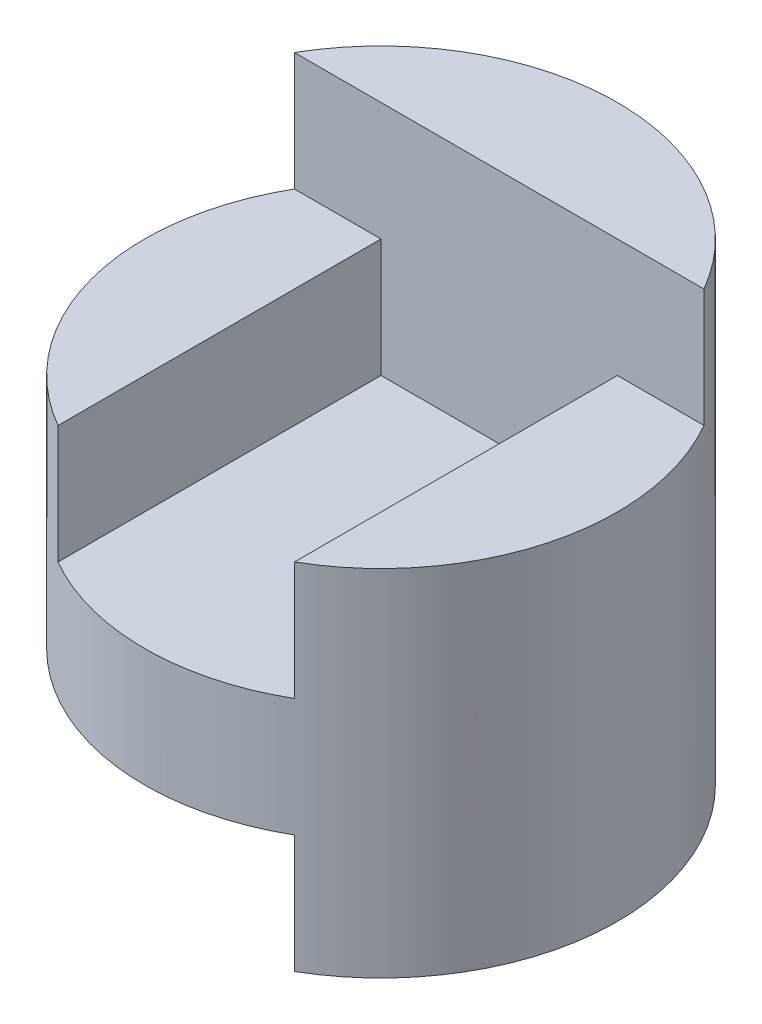
ISO-10303-21;
HEADER;
FILE_DESCRIPTION(('STEP AP214'),'2;1');
FILE_NAME('part.step','',(''),(''),'','','');
FILE_SCHEMA(('AUTOMOTIVE_DESIGN { 1 0 10303 214 1 1 1 1 }'));
ENDSEC;
DATA;
#1=APPLICATION_CONTEXT('core data for automotive mechanical design processes');
#2=APPLICATION_PROTOCOL_DEFINITION('international standard','automotive_design',2000,#1);
#3=PRODUCT_CONTEXT('',#1,'mechanical');
#4=PRODUCT('Part','Part','',(#3));
#5=PRODUCT_RELATED_PRODUCT_CATEGORY('part','',(#4));
#6=PRODUCT_DEFINITION_FORMATION('','',#4);
#7=PRODUCT_DEFINITION_CONTEXT('part definition',#1,'design');
#8=PRODUCT_DEFINITION('design','',#6,#7);
#9=PRODUCT_DEFINITION_SHAPE('','',#8);
#10=(LENGTH_UNIT() NAMED_UNIT(*) SI_UNIT(.MILLI.,.METRE.));
#11=(NAMED_UNIT(*) PLANE_ANGLE_UNIT() SI_UNIT($,.RADIAN.));
#12=(NAMED_UNIT(*) SI_UNIT($,.STERADIAN.) SOLID_ANGLE_UNIT());
#13=UNCERTAINTY_MEASURE_WITH_UNIT(LENGTH_MEASURE(1.E-05),#10,'distance_accuracy_value','');
#14=(GEOMETRIC_REPRESENTATION_CONTEXT(3) GLOBAL_UNCERTAINTY_ASSIGNED_CONTEXT((#13)) GLOBAL_UNIT_ASSIGNED_CONTEXT((#10,
#11,#12)) REPRESENTATION_CONTEXT('',''));
#15=CARTESIAN_POINT('',(0.,0.,0.));
#16=DIRECTION('',(0.,0.,1.));
#17=DIRECTION('',(1.,0.,0.));
#18=AXIS2_PLACEMENT_3D('',#15,#16,#17);
#19=CARTESIAN_POINT('',(0.,4.,0.));
#20=DIRECTION('',(0.,-1.,0.));
#21=DIRECTION('',(0.,0.,-1.));
#22=AXIS2_PLACEMENT_3D('',#19,#20,#21);
#23=CYLINDRICAL_SURFACE('',#22,2.);
#24=CARTESIAN_POINT('',(0.,0.,0.));
#25=DIRECTION('',(0.,1.,0.));
#26=DIRECTION('',(0.,0.,1.));
#27=AXIS2_PLACEMENT_3D('',#24,#25,#26);
#28=CIRCLE('',#27,2.);
#29=CARTESIAN_POINT('',(1.,0.,1.73205080756888));
#30=VERTEX_POINT('',#29);
#31=CARTESIAN_POINT('',(-1.73205080756888,0.,-1.));
#32=VERTEX_POINT('',#31);
#33=EDGE_CURVE('E155',#30,#32,#28,.T.);
#34=ORIENTED_EDGE('',*,*,#33,.T.);
#35=DIRECTION('',(0.,-1.,0.));
#36=VECTOR('',#35,1.);
#37=CARTESIAN_POINT('',(-1.73205080756888,1.,-1.));
#38=LINE('',#37,#36);
#39=CARTESIAN_POINT('',(-1.73205080756888,1.,-1.));
#40=VERTEX_POINT('',#39);
#41=EDGE_CURVE('E126',#40,#32,#38,.T.);
#42=ORIENTED_EDGE('',*,*,#41,.F.);
#43=CARTESIAN_POINT('',(0.,1.,0.));
#44=DIRECTION('',(0.,-1.,0.));
#45=DIRECTION('',(0.,0.,1.));
#46=AXIS2_PLACEMENT_3D('',#43,#44,#45);
#47=CIRCLE('',#46,2.);
#48=CARTESIAN_POINT('',(1.,1.,1.73205080756888));
#49=VERTEX_POINT('',#48);
#50=EDGE_CURVE('E109',#49,#40,#47,.T.);
#51=ORIENTED_EDGE('',*,*,#50,.F.);
#52=DIRECTION('',(0.,-1.,0.));
#53=VECTOR('',#52,1.);
#54=CARTESIAN_POINT('',(1.,1.,1.73205080756888));
#55=LINE('',#54,#53);
#56=EDGE_CURVE('E108',#49,#30,#55,.T.);
#57=ORIENTED_EDGE('',*,*,#56,.T.);
#58=EDGE_LOOP('',(#34,#42,#51,#57));
#59=FACE_BOUND('',#58,.T.);
#60=DIRECTION('',(0.,-1.,0.));
#61=VECTOR('',#60,1.);
#62=CARTESIAN_POINT('',(1.73205080756888,4.,-1.));
#63=LINE('',#62,#61);
#64=CARTESIAN_POINT('',(1.73205080756888,4.,-1.));
#65=VERTEX_POINT('',#64);
#66=CARTESIAN_POINT('',(1.73205080756888,3.,-1.));
#67=VERTEX_POINT('',#66);
#68=EDGE_CURVE('E55',#65,#67,#63,.T.);
#69=ORIENTED_EDGE('',*,*,#68,.T.);
#70=CARTESIAN_POINT('',(0.,3.,0.));
#71=DIRECTION('',(0.,1.,0.));
#72=DIRECTION('',(0.,0.,1.));
#73=AXIS2_PLACEMENT_3D('',#70,#71,#72);
#74=CIRCLE('',#73,2.);
#75=CARTESIAN_POINT('',(1.,3.,1.73205080756888));
#76=VERTEX_POINT('',#75);
#77=EDGE_CURVE('E11',#76,#67,#74,.T.);
#78=ORIENTED_EDGE('',*,*,#77,.F.);
#79=DIRECTION('',(0.,-1.,0.));
#80=VECTOR('',#79,1.);
#81=CARTESIAN_POINT('',(1.,4.,1.73205080756888));
#82=LINE('',#81,#80);
#83=CARTESIAN_POINT('',(1.,2.,1.73205080756888));
#84=VERTEX_POINT('',#83);
#85=EDGE_CURVE('E40',#84,#76,#82,.F.);
#86=ORIENTED_EDGE('',*,*,#85,.F.);
#87=CARTESIAN_POINT('',(0.,2.,0.));
#88=DIRECTION('',(0.,1.,0.));
#89=DIRECTION('',(-1.,0.,0.));
#90=AXIS2_PLACEMENT_3D('',#87,#88,#89);
#91=CIRCLE('',#90,2.);
#92=CARTESIAN_POINT('',(-1.,2.,1.73205080756888));
#93=VERTEX_POINT('',#92);
#94=EDGE_CURVE('E167',#93,#84,#91,.T.);
#95=ORIENTED_EDGE('',*,*,#94,.F.);
#96=DIRECTION('',(0.,-1.,0.));
#97=VECTOR('',#96,1.);
#98=CARTESIAN_POINT('',(-1.,4.,1.73205080756888));
#99=LINE('',#98,#97);
#100=CARTESIAN_POINT('',(-1.,3.,1.73205080756888));
#101=VERTEX_POINT('',#100);
#102=EDGE_CURVE('E165',#101,#93,#99,.T.);
#103=ORIENTED_EDGE('',*,*,#102,.F.);
#104=CARTESIAN_POINT('',(0.,3.,0.));
#105=DIRECTION('',(0.,1.,0.));
#106=DIRECTION('',(-1.,0.,0.));
#107=AXIS2_PLACEMENT_3D('',#104,#105,#106);
#108=CIRCLE('',#107,2.);
#109=CARTESIAN_POINT('',(-1.73205080756888,3.,-1.));
#110=VERTEX_POINT('',#109);
#111=EDGE_CURVE('E163',#110,#101,#108,.T.);
#112=ORIENTED_EDGE('',*,*,#111,.F.);
#113=DIRECTION('',(0.,-1.,0.));
#114=VECTOR('',#113,1.);
#115=CARTESIAN_POINT('',(-1.73205080756888,4.,-1.));
#116=LINE('',#115,#114);
#117=CARTESIAN_POINT('',(-1.73205080756888,4.,-1.));
#118=VERTEX_POINT('',#117);
#119=EDGE_CURVE('E151',#110,#118,#116,.F.);
#120=ORIENTED_EDGE('',*,*,#119,.T.);
#121=CARTESIAN_POINT('',(0.,4.,0.));
#122=DIRECTION('',(0.,1.,0.));
#123=DIRECTION('',(0.,0.,1.));
#124=AXIS2_PLACEMENT_3D('',#121,#122,#123);
#125=CIRCLE('',#124,2.);
#126=EDGE_CURVE('E156',#65,#118,#125,.T.);
#127=ORIENTED_EDGE('',*,*,#126,.F.);
#128=EDGE_LOOP('',(#69,#78,#86,#95,#103,#112,#120,#127));
#129=FACE_BOUND('',#128,.T.);
#130=ADVANCED_FACE('F33',(#59,#129),#23,.T.);
#131=CARTESIAN_POINT('',(0.,4.,0.));
#132=DIRECTION('',(0.,1.,0.));
#133=DIRECTION('',(0.,0.,1.));
#134=AXIS2_PLACEMENT_3D('',#131,#132,#133);
#135=PLANE('',#134);
#136=DIRECTION('',(-1.,0.,0.));
#137=VECTOR('',#136,1.);
#138=CARTESIAN_POINT('',(0.,4.,-1.));
#139=LINE('',#138,#137);
#140=EDGE_CURVE('E159',#65,#118,#139,.T.);
#141=ORIENTED_EDGE('',*,*,#140,.F.);
#142=ORIENTED_EDGE('',*,*,#126,.T.);
#143=EDGE_LOOP('',(#141,#142));
#144=FACE_BOUND('',#143,.T.);
#145=ADVANCED_FACE('F183',(#144),#135,.T.);
#146=CARTESIAN_POINT('',(0.,0.,0.));
#147=DIRECTION('',(0.,1.,0.));
#148=DIRECTION('',(0.,0.,1.));
#149=AXIS2_PLACEMENT_3D('',#146,#147,#148);
#150=PLANE('',#149);
#151=DIRECTION('',(0.,0.,1.));
#152=VECTOR('',#151,1.);
#153=CARTESIAN_POINT('',(1.,0.,1.73205080756888));
#154=LINE('',#153,#152);
#155=CARTESIAN_POINT('',(1.,0.,-1.));
#156=VERTEX_POINT('',#155);
#157=EDGE_CURVE('E121',#156,#30,#154,.T.);
#158=ORIENTED_EDGE('',*,*,#157,.F.);
#159=DIRECTION('',(1.,0.,0.));
#160=VECTOR('',#159,1.);
#161=CARTESIAN_POINT('',(-1.,0.,-1.));
#162=LINE('',#161,#160);
#163=EDGE_CURVE('E106',#32,#156,#162,.T.);
#164=ORIENTED_EDGE('',*,*,#163,.F.);
#165=ORIENTED_EDGE('',*,*,#33,.F.);
#166=EDGE_LOOP('',(#158,#164,#165));
#167=FACE_BOUND('',#166,.T.);
#168=ADVANCED_FACE('F210',(#167),#150,.F.);
#169=CARTESIAN_POINT('',(-1.,3.,3.));
#170=DIRECTION('',(0.,1.,0.));
#171=DIRECTION('',(-1.,0.,0.));
#172=AXIS2_PLACEMENT_3D('',#169,#170,#171);
#173=PLANE('',#172);
#174=ORIENTED_EDGE('',*,*,#111,.T.);
#175=DIRECTION('',(0.,0.,-1.));
#176=VECTOR('',#175,1.);
#177=CARTESIAN_POINT('',(-1.,3.,3.));
#178=LINE('',#177,#176);
#179=CARTESIAN_POINT('',(-1.,3.,-1.));
#180=VERTEX_POINT('',#179);
#181=EDGE_CURVE('E149',#101,#180,#178,.T.);
#182=ORIENTED_EDGE('',*,*,#181,.T.);
#183=DIRECTION('',(1.,0.,0.));
#184=VECTOR('',#183,1.);
#185=CARTESIAN_POINT('',(-1.,3.,-1.));
#186=LINE('',#185,#184);
#187=EDGE_CURVE('E128',#110,#180,#186,.T.);
#188=ORIENTED_EDGE('',*,*,#187,.F.);
#189=EDGE_LOOP('',(#174,#182,#188));
#190=FACE_BOUND('',#189,.T.);
#191=ADVANCED_FACE('F188',(#190),#173,.T.);
#192=CARTESIAN_POINT('',(-1.,2.,3.));
#193=DIRECTION('',(1.,0.,0.));
#194=DIRECTION('',(0.,0.,-1.));
#195=AXIS2_PLACEMENT_3D('',#192,#193,#194);
#196=PLANE('',#195);
#197=ORIENTED_EDGE('',*,*,#102,.T.);
#198=DIRECTION('',(0.,0.,-1.));
#199=VECTOR('',#198,1.);
#200=CARTESIAN_POINT('',(-1.,2.,3.));
#201=LINE('',#200,#199);
#202=CARTESIAN_POINT('',(-1.,2.,-1.));
#203=VERTEX_POINT('',#202);
#204=EDGE_CURVE('E147',#93,#203,#201,.T.);
#205=ORIENTED_EDGE('',*,*,#204,.T.);
#206=DIRECTION('',(0.,-1.,0.));
#207=VECTOR('',#206,1.);
#208=CARTESIAN_POINT('',(-1.,2.,-1.));
#209=LINE('',#208,#207);
#210=EDGE_CURVE('E132',#180,#203,#209,.T.);
#211=ORIENTED_EDGE('',*,*,#210,.F.);
#212=ORIENTED_EDGE('',*,*,#181,.F.);
#213=EDGE_LOOP('',(#197,#205,#211,#212));
#214=FACE_BOUND('',#213,.T.);
#215=ADVANCED_FACE('F193',(#214),#196,.T.);
#216=CARTESIAN_POINT('',(1.,2.,3.));
#217=DIRECTION('',(0.,1.,0.));
#218=DIRECTION('',(-1.,0.,0.));
#219=AXIS2_PLACEMENT_3D('',#216,#217,#218);
#220=PLANE('',#219);
#221=ORIENTED_EDGE('',*,*,#94,.T.);
#222=DIRECTION('',(0.,0.,-1.));
#223=VECTOR('',#222,1.);
#224=CARTESIAN_POINT('',(1.,2.,3.));
#225=LINE('',#224,#223);
#226=CARTESIAN_POINT('',(1.,2.,-1.));
#227=VERTEX_POINT('',#226);
#228=EDGE_CURVE('E145',#84,#227,#225,.T.);
#229=ORIENTED_EDGE('',*,*,#228,.T.);
#230=DIRECTION('',(1.,0.,0.));
#231=VECTOR('',#230,1.);
#232=CARTESIAN_POINT('',(1.,2.,-1.));
#233=LINE('',#232,#231);
#234=EDGE_CURVE('E135',#203,#227,#233,.T.);
#235=ORIENTED_EDGE('',*,*,#234,.F.);
#236=ORIENTED_EDGE('',*,*,#204,.F.);
#237=EDGE_LOOP('',(#221,#229,#235,#236));
#238=FACE_BOUND('',#237,.T.);
#239=ADVANCED_FACE('F196',(#238),#220,.T.);
#240=CARTESIAN_POINT('',(1.,3.,3.));
#241=DIRECTION('',(-1.,0.,0.));
#242=DIRECTION('',(0.,-1.,0.));
#243=AXIS2_PLACEMENT_3D('',#240,#241,#242);
#244=PLANE('',#243);
#245=ORIENTED_EDGE('',*,*,#85,.T.);
#246=DIRECTION('',(0.,0.,-1.));
#247=VECTOR('',#246,1.);
#248=CARTESIAN_POINT('',(1.,3.,3.));
#249=LINE('',#248,#247);
#250=CARTESIAN_POINT('',(1.,3.,-1.));
#251=VERTEX_POINT('',#250);
#252=EDGE_CURVE('E143',#76,#251,#249,.T.);
#253=ORIENTED_EDGE('',*,*,#252,.T.);
#254=DIRECTION('',(0.,1.,0.));
#255=VECTOR('',#254,1.);
#256=CARTESIAN_POINT('',(1.,3.,-1.));
#257=LINE('',#256,#255);
#258=EDGE_CURVE('E138',#227,#251,#257,.T.);
#259=ORIENTED_EDGE('',*,*,#258,.F.);
#260=ORIENTED_EDGE('',*,*,#228,.F.);
#261=EDGE_LOOP('',(#245,#253,#259,#260));
#262=FACE_BOUND('',#261,.T.);
#263=ADVANCED_FACE('F172',(#262),#244,.T.);
#264=CARTESIAN_POINT('',(2.,3.,3.));
#265=DIRECTION('',(0.,1.,0.));
#266=DIRECTION('',(0.,0.,1.));
#267=AXIS2_PLACEMENT_3D('',#264,#265,#266);
#268=PLANE('',#267);
#269=ORIENTED_EDGE('',*,*,#77,.T.);
#270=DIRECTION('',(1.,0.,0.));
#271=VECTOR('',#270,1.);
#272=CARTESIAN_POINT('',(2.,3.,-1.));
#273=LINE('',#272,#271);
#274=EDGE_CURVE('E141',#251,#67,#273,.T.);
#275=ORIENTED_EDGE('',*,*,#274,.F.);
#276=ORIENTED_EDGE('',*,*,#252,.F.);
#277=EDGE_LOOP('',(#269,#275,#276));
#278=FACE_BOUND('',#277,.T.);
#279=ADVANCED_FACE('F179',(#278),#268,.T.);
#280=CARTESIAN_POINT('',(0.,0.,-1.));
#281=DIRECTION('',(0.,0.,-1.));
#282=DIRECTION('',(-1.,0.,0.));
#283=AXIS2_PLACEMENT_3D('',#280,#281,#282);
#284=PLANE('',#283);
#285=ORIENTED_EDGE('',*,*,#140,.T.);
#286=ORIENTED_EDGE('',*,*,#119,.F.);
#287=ORIENTED_EDGE('',*,*,#187,.T.);
#288=ORIENTED_EDGE('',*,*,#210,.T.);
#289=ORIENTED_EDGE('',*,*,#234,.T.);
#290=ORIENTED_EDGE('',*,*,#258,.T.);
#291=ORIENTED_EDGE('',*,*,#274,.T.);
#292=ORIENTED_EDGE('',*,*,#68,.F.);
#293=EDGE_LOOP('',(#285,#286,#287,#288,#289,#290,#291,#292));
#294=FACE_BOUND('',#293,.T.);
#295=ADVANCED_FACE('F184',(#294),#284,.F.);
#296=CARTESIAN_POINT('',(-1.,1.,-1.));
#297=DIRECTION('',(0.,0.,-1.));
#298=DIRECTION('',(-1.,0.,0.));
#299=AXIS2_PLACEMENT_3D('',#296,#297,#298);
#300=PLANE('',#299);
#301=ORIENTED_EDGE('',*,*,#163,.T.);
#302=DIRECTION('',(0.,-1.,0.));
#303=VECTOR('',#302,1.);
#304=CARTESIAN_POINT('',(1.,1.,-1.));
#305=LINE('',#304,#303);
#306=CARTESIAN_POINT('',(1.,1.,-1.));
#307=VERTEX_POINT('',#306);
#308=EDGE_CURVE('E47',#307,#156,#305,.T.);
#309=ORIENTED_EDGE('',*,*,#308,.F.);
#310=DIRECTION('',(1.,0.,0.));
#311=VECTOR('',#310,1.);
#312=CARTESIAN_POINT('',(1.,1.,-1.));
#313=LINE('',#312,#311);
#314=EDGE_CURVE('E103',#40,#307,#313,.T.);
#315=ORIENTED_EDGE('',*,*,#314,.F.);
#316=ORIENTED_EDGE('',*,*,#41,.T.);
#317=EDGE_LOOP('',(#301,#309,#315,#316));
#318=FACE_BOUND('',#317,.T.);
#319=ADVANCED_FACE('F101',(#318),#300,.F.);
#320=CARTESIAN_POINT('',(1.,1.,1.73205080756888));
#321=DIRECTION('',(1.,0.,0.));
#322=DIRECTION('',(0.,0.,-1.));
#323=AXIS2_PLACEMENT_3D('',#320,#321,#322);
#324=PLANE('',#323);
#325=ORIENTED_EDGE('',*,*,#157,.T.);
#326=ORIENTED_EDGE('',*,*,#56,.F.);
#327=DIRECTION('',(0.,0.,1.));
#328=VECTOR('',#327,1.);
#329=CARTESIAN_POINT('',(1.,1.,1.73205080756888));
#330=LINE('',#329,#328);
#331=EDGE_CURVE('E112',#307,#49,#330,.T.);
#332=ORIENTED_EDGE('',*,*,#331,.F.);
#333=ORIENTED_EDGE('',*,*,#308,.T.);
#334=EDGE_LOOP('',(#325,#326,#332,#333));
#335=FACE_BOUND('',#334,.T.);
#336=ADVANCED_FACE('F113',(#335),#324,.F.);
#337=CARTESIAN_POINT('',(0.,1.,0.));
#338=DIRECTION('',(0.,1.,0.));
#339=DIRECTION('',(0.,0.,1.));
#340=AXIS2_PLACEMENT_3D('',#337,#338,#339);
#341=PLANE('',#340);
#342=ORIENTED_EDGE('',*,*,#314,.T.);
#343=ORIENTED_EDGE('',*,*,#331,.T.);
#344=ORIENTED_EDGE('',*,*,#50,.T.);
#345=EDGE_LOOP('',(#342,#343,#344));
#346=FACE_BOUND('',#345,.T.);
#347=ADVANCED_FACE('F118',(#346),#341,.F.);
#348=CLOSED_SHELL('',(#130,#145,#168,#191,#215,#239,#263,#279,#295,#319,#336,#347));
#349=MANIFOLD_SOLID_BREP('B2',#348);
#350=ADVANCED_BREP_SHAPE_REPRESENTATION('',(#18,#349),#14);
#351=SHAPE_DEFINITION_REPRESENTATION(#9,#350);
ENDSEC;
END-ISO-10303-21;
